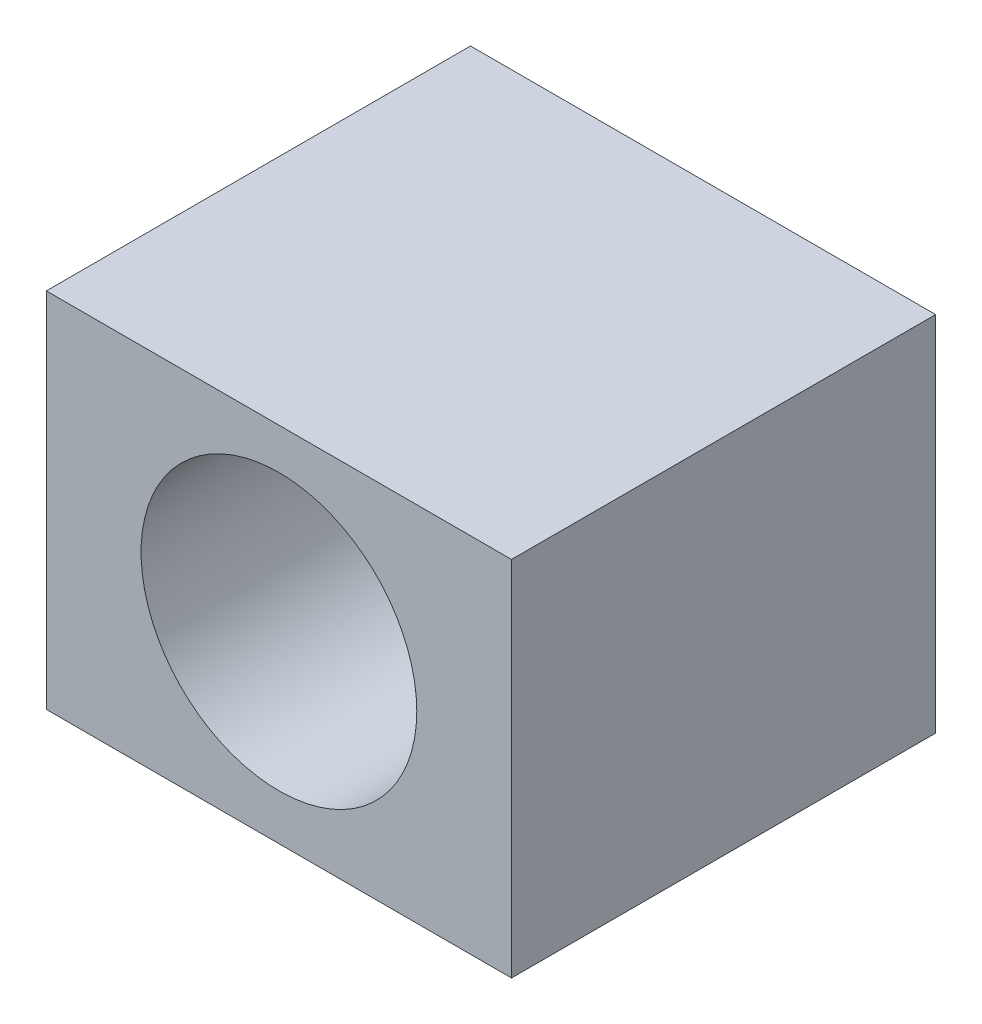
ISO-10303-21;
HEADER;
FILE_DESCRIPTION(('STEP AP214'),'2;1');
FILE_NAME('part.step','',(''),(''),'','','');
FILE_SCHEMA(('AUTOMOTIVE_DESIGN { 1 0 10303 214 1 1 1 1 }'));
ENDSEC;
DATA;
#1=APPLICATION_CONTEXT('core data for automotive mechanical design processes');
#2=APPLICATION_PROTOCOL_DEFINITION('international standard','automotive_design',2000,#1);
#3=PRODUCT_CONTEXT('',#1,'mechanical');
#4=PRODUCT('Part','Part','',(#3));
#5=PRODUCT_RELATED_PRODUCT_CATEGORY('part','',(#4));
#6=PRODUCT_DEFINITION_FORMATION('','',#4);
#7=PRODUCT_DEFINITION_CONTEXT('part definition',#1,'design');
#8=PRODUCT_DEFINITION('design','',#6,#7);
#9=PRODUCT_DEFINITION_SHAPE('','',#8);
#10=(LENGTH_UNIT() NAMED_UNIT(*) SI_UNIT(.MILLI.,.METRE.));
#11=(NAMED_UNIT(*) PLANE_ANGLE_UNIT() SI_UNIT($,.RADIAN.));
#12=(NAMED_UNIT(*) SI_UNIT($,.STERADIAN.) SOLID_ANGLE_UNIT());
#13=UNCERTAINTY_MEASURE_WITH_UNIT(LENGTH_MEASURE(1.E-05),#10,'distance_accuracy_value','');
#14=(GEOMETRIC_REPRESENTATION_CONTEXT(3) GLOBAL_UNCERTAINTY_ASSIGNED_CONTEXT((#13)) GLOBAL_UNIT_ASSIGNED_CONTEXT((#10,
#11,#12)) REPRESENTATION_CONTEXT('',''));
#15=CARTESIAN_POINT('',(0.,0.,0.));
#16=DIRECTION('',(0.,0.,1.));
#17=DIRECTION('',(1.,0.,0.));
#18=AXIS2_PLACEMENT_3D('',#15,#16,#17);
#19=CARTESIAN_POINT('',(0.,0.,80.));
#20=DIRECTION('',(0.,0.,1.));
#21=DIRECTION('',(1.,0.,0.));
#22=AXIS2_PLACEMENT_3D('',#19,#20,#21);
#23=PLANE('',#22);
#24=DIRECTION('',(0.,-1.,0.));
#25=VECTOR('',#24,1.);
#26=CARTESIAN_POINT('',(-45.5069536921983,33.7281096061183,80.));
#27=LINE('',#26,#25);
#28=CARTESIAN_POINT('',(-45.5069536921983,33.7281096061183,80.));
#29=VERTEX_POINT('',#28);
#30=CARTESIAN_POINT('',(-45.5069536921983,-34.640515477709,80.));
#31=VERTEX_POINT('',#30);
#32=EDGE_CURVE('E87',#29,#31,#27,.T.);
#33=ORIENTED_EDGE('',*,*,#32,.T.);
#34=DIRECTION('',(1.,0.,0.));
#35=VECTOR('',#34,1.);
#36=CARTESIAN_POINT('',(-45.5069536921983,-34.640515477709,80.));
#37=LINE('',#36,#35);
#38=CARTESIAN_POINT('',(42.2327818320468,-34.640515477709,80.));
#39=VERTEX_POINT('',#38);
#40=EDGE_CURVE('E82',#31,#39,#37,.T.);
#41=ORIENTED_EDGE('',*,*,#40,.T.);
#42=DIRECTION('',(0.,1.,0.));
#43=VECTOR('',#42,1.);
#44=CARTESIAN_POINT('',(42.2327818320468,33.7281096061183,80.));
#45=LINE('',#44,#43);
#46=CARTESIAN_POINT('',(42.2327818320468,33.7281096061183,80.));
#47=VERTEX_POINT('',#46);
#48=EDGE_CURVE('E85',#39,#47,#45,.T.);
#49=ORIENTED_EDGE('',*,*,#48,.T.);
#50=DIRECTION('',(-1.,0.,0.));
#51=VECTOR('',#50,1.);
#52=CARTESIAN_POINT('',(-45.5069536921983,33.7281096061183,80.));
#53=LINE('',#52,#51);
#54=EDGE_CURVE('E52',#47,#29,#53,.T.);
#55=ORIENTED_EDGE('',*,*,#54,.T.);
#56=EDGE_LOOP('',(#33,#41,#49,#55));
#57=FACE_BOUND('',#56,.T.);
#58=CARTESIAN_POINT('',(-1.63708593007571,0.,80.));
#59=DIRECTION('',(0.,0.,1.));
#60=DIRECTION('',(1.,0.,0.));
#61=AXIS2_PLACEMENT_3D('',#58,#59,#60);
#62=CIRCLE('',#61,26.);
#63=CARTESIAN_POINT('',(24.3629140699243,0.,80.));
#64=VERTEX_POINT('',#63);
#65=EDGE_CURVE('E102',#64,#64,#62,.T.);
#66=ORIENTED_EDGE('',*,*,#65,.F.);
#67=EDGE_LOOP('',(#66));
#68=FACE_BOUND('',#67,.T.);
#69=ADVANCED_FACE('F35',(#57,#68),#23,.T.);
#70=CARTESIAN_POINT('',(0.,0.,0.));
#71=DIRECTION('',(0.,0.,1.));
#72=DIRECTION('',(1.,0.,0.));
#73=AXIS2_PLACEMENT_3D('',#70,#71,#72);
#74=PLANE('',#73);
#75=DIRECTION('',(0.,-1.,0.));
#76=VECTOR('',#75,1.);
#77=CARTESIAN_POINT('',(-45.5069536921983,33.7281096061183,0.));
#78=LINE('',#77,#76);
#79=CARTESIAN_POINT('',(-45.5069536921983,33.7281096061183,0.));
#80=VERTEX_POINT('',#79);
#81=CARTESIAN_POINT('',(-45.5069536921983,-34.640515477709,0.));
#82=VERTEX_POINT('',#81);
#83=EDGE_CURVE('E99',#80,#82,#78,.T.);
#84=ORIENTED_EDGE('',*,*,#83,.F.);
#85=DIRECTION('',(-1.,0.,0.));
#86=VECTOR('',#85,1.);
#87=CARTESIAN_POINT('',(-45.5069536921983,33.7281096061183,0.));
#88=LINE('',#87,#86);
#89=CARTESIAN_POINT('',(42.2327818320468,33.7281096061183,0.));
#90=VERTEX_POINT('',#89);
#91=EDGE_CURVE('E75',#90,#80,#88,.T.);
#92=ORIENTED_EDGE('',*,*,#91,.F.);
#93=DIRECTION('',(0.,1.,0.));
#94=VECTOR('',#93,1.);
#95=CARTESIAN_POINT('',(42.2327818320468,33.7281096061183,0.));
#96=LINE('',#95,#94);
#97=CARTESIAN_POINT('',(42.2327818320468,-34.640515477709,0.));
#98=VERTEX_POINT('',#97);
#99=EDGE_CURVE('E69',#98,#90,#96,.T.);
#100=ORIENTED_EDGE('',*,*,#99,.F.);
#101=DIRECTION('',(1.,0.,0.));
#102=VECTOR('',#101,1.);
#103=CARTESIAN_POINT('',(-45.5069536921983,-34.640515477709,0.));
#104=LINE('',#103,#102);
#105=EDGE_CURVE('E91',#82,#98,#104,.T.);
#106=ORIENTED_EDGE('',*,*,#105,.F.);
#107=EDGE_LOOP('',(#84,#92,#100,#106));
#108=FACE_BOUND('',#107,.T.);
#109=CARTESIAN_POINT('',(-1.63708593007571,0.,0.));
#110=DIRECTION('',(0.,0.,1.));
#111=DIRECTION('',(1.,0.,0.));
#112=AXIS2_PLACEMENT_3D('',#109,#110,#111);
#113=CIRCLE('',#112,26.);
#114=CARTESIAN_POINT('',(24.3629140699243,0.,0.));
#115=VERTEX_POINT('',#114);
#116=EDGE_CURVE('E114',#115,#115,#113,.T.);
#117=ORIENTED_EDGE('',*,*,#116,.T.);
#118=EDGE_LOOP('',(#117));
#119=FACE_BOUND('',#118,.T.);
#120=ADVANCED_FACE('F110',(#108,#119),#74,.F.);
#121=CARTESIAN_POINT('',(-45.5069536921983,33.7281096061183,80.));
#122=DIRECTION('',(1.,0.,0.));
#123=DIRECTION('',(0.,0.,-1.));
#124=AXIS2_PLACEMENT_3D('',#121,#122,#123);
#125=PLANE('',#124);
#126=ORIENTED_EDGE('',*,*,#83,.T.);
#127=DIRECTION('',(0.,0.,-1.));
#128=VECTOR('',#127,1.);
#129=CARTESIAN_POINT('',(-45.5069536921983,-34.640515477709,80.));
#130=LINE('',#129,#128);
#131=EDGE_CURVE('E11',#31,#82,#130,.T.);
#132=ORIENTED_EDGE('',*,*,#131,.F.);
#133=ORIENTED_EDGE('',*,*,#32,.F.);
#134=DIRECTION('',(0.,0.,-1.));
#135=VECTOR('',#134,1.);
#136=CARTESIAN_POINT('',(-45.5069536921983,33.7281096061183,80.));
#137=LINE('',#136,#135);
#138=EDGE_CURVE('E95',#29,#80,#137,.T.);
#139=ORIENTED_EDGE('',*,*,#138,.T.);
#140=EDGE_LOOP('',(#126,#132,#133,#139));
#141=FACE_BOUND('',#140,.T.);
#142=ADVANCED_FACE('F37',(#141),#125,.F.);
#143=CARTESIAN_POINT('',(-45.5069536921983,-34.640515477709,80.));
#144=DIRECTION('',(0.,1.,0.));
#145=DIRECTION('',(0.,0.,1.));
#146=AXIS2_PLACEMENT_3D('',#143,#144,#145);
#147=PLANE('',#146);
#148=ORIENTED_EDGE('',*,*,#105,.T.);
#149=DIRECTION('',(0.,0.,-1.));
#150=VECTOR('',#149,1.);
#151=CARTESIAN_POINT('',(42.2327818320468,-34.640515477709,80.));
#152=LINE('',#151,#150);
#153=EDGE_CURVE('E44',#39,#98,#152,.T.);
#154=ORIENTED_EDGE('',*,*,#153,.F.);
#155=ORIENTED_EDGE('',*,*,#40,.F.);
#156=ORIENTED_EDGE('',*,*,#131,.T.);
#157=EDGE_LOOP('',(#148,#154,#155,#156));
#158=FACE_BOUND('',#157,.T.);
#159=ADVANCED_FACE('F90',(#158),#147,.F.);
#160=CARTESIAN_POINT('',(42.2327818320468,33.7281096061183,80.));
#161=DIRECTION('',(-1.,0.,0.));
#162=DIRECTION('',(0.,0.,1.));
#163=AXIS2_PLACEMENT_3D('',#160,#161,#162);
#164=PLANE('',#163);
#165=ORIENTED_EDGE('',*,*,#99,.T.);
#166=DIRECTION('',(0.,0.,-1.));
#167=VECTOR('',#166,1.);
#168=CARTESIAN_POINT('',(42.2327818320468,33.7281096061183,80.));
#169=LINE('',#168,#167);
#170=EDGE_CURVE('E92',#47,#90,#169,.T.);
#171=ORIENTED_EDGE('',*,*,#170,.F.);
#172=ORIENTED_EDGE('',*,*,#48,.F.);
#173=ORIENTED_EDGE('',*,*,#153,.T.);
#174=EDGE_LOOP('',(#165,#171,#172,#173));
#175=FACE_BOUND('',#174,.T.);
#176=ADVANCED_FACE('F93',(#175),#164,.F.);
#177=CARTESIAN_POINT('',(-45.5069536921983,33.7281096061183,80.));
#178=DIRECTION('',(0.,-1.,0.));
#179=DIRECTION('',(0.,0.,-1.));
#180=AXIS2_PLACEMENT_3D('',#177,#178,#179);
#181=PLANE('',#180);
#182=ORIENTED_EDGE('',*,*,#91,.T.);
#183=ORIENTED_EDGE('',*,*,#138,.F.);
#184=ORIENTED_EDGE('',*,*,#54,.F.);
#185=ORIENTED_EDGE('',*,*,#170,.T.);
#186=EDGE_LOOP('',(#182,#183,#184,#185));
#187=FACE_BOUND('',#186,.T.);
#188=ADVANCED_FACE('F107',(#187),#181,.F.);
#189=CARTESIAN_POINT('',(-1.63708593007571,0.,80.));
#190=DIRECTION('',(0.,0.,-1.));
#191=DIRECTION('',(-1.,0.,0.));
#192=AXIS2_PLACEMENT_3D('',#189,#190,#191);
#193=CYLINDRICAL_SURFACE('',#192,26.);
#194=ORIENTED_EDGE('',*,*,#65,.T.);
#195=EDGE_LOOP('',(#194));
#196=FACE_BOUND('',#195,.T.);
#197=ORIENTED_EDGE('',*,*,#116,.F.);
#198=EDGE_LOOP('',(#197));
#199=FACE_BOUND('',#198,.T.);
#200=ADVANCED_FACE('F120',(#196,#199),#193,.F.);
#201=CLOSED_SHELL('',(#69,#120,#142,#159,#176,#188,#200));
#202=MANIFOLD_SOLID_BREP('B2',#201);
#203=ADVANCED_BREP_SHAPE_REPRESENTATION('',(#18,#202),#14);
#204=SHAPE_DEFINITION_REPRESENTATION(#9,#203);
ENDSEC;
END-ISO-10303-21;
